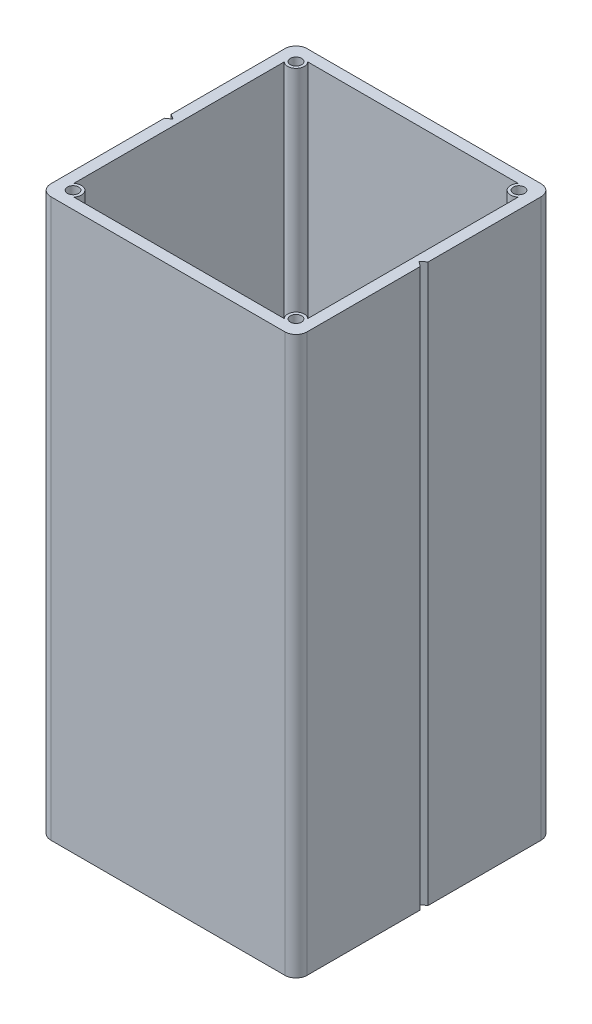
ISO-10303-21;
HEADER;
FILE_DESCRIPTION(('STEP AP214'),'2;1');
FILE_NAME('part.step','',(''),(''),'','','');
FILE_SCHEMA(('AUTOMOTIVE_DESIGN { 1 0 10303 214 1 1 1 1 }'));
ENDSEC;
DATA;
#1=APPLICATION_CONTEXT('core data for automotive mechanical design processes');
#2=APPLICATION_PROTOCOL_DEFINITION('international standard','automotive_design',2000,#1);
#3=PRODUCT_CONTEXT('',#1,'mechanical');
#4=PRODUCT('Part','Part','',(#3));
#5=PRODUCT_RELATED_PRODUCT_CATEGORY('part','',(#4));
#6=PRODUCT_DEFINITION_FORMATION('','',#4);
#7=PRODUCT_DEFINITION_CONTEXT('part definition',#1,'design');
#8=PRODUCT_DEFINITION('design','',#6,#7);
#9=PRODUCT_DEFINITION_SHAPE('','',#8);
#10=(LENGTH_UNIT() NAMED_UNIT(*) SI_UNIT(.MILLI.,.METRE.));
#11=(NAMED_UNIT(*) PLANE_ANGLE_UNIT() SI_UNIT($,.RADIAN.));
#12=(NAMED_UNIT(*) SI_UNIT($,.STERADIAN.) SOLID_ANGLE_UNIT());
#13=UNCERTAINTY_MEASURE_WITH_UNIT(LENGTH_MEASURE(1.E-05),#10,'distance_accuracy_value','');
#14=(GEOMETRIC_REPRESENTATION_CONTEXT(3) GLOBAL_UNCERTAINTY_ASSIGNED_CONTEXT((#13)) GLOBAL_UNIT_ASSIGNED_CONTEXT((#10,
#11,#12)) REPRESENTATION_CONTEXT('',''));
#15=CARTESIAN_POINT('',(0.,0.,0.));
#16=DIRECTION('',(0.,0.,1.));
#17=DIRECTION('',(1.,0.,0.));
#18=AXIS2_PLACEMENT_3D('',#15,#16,#17);
#19=CARTESIAN_POINT('',(0.,100.,0.));
#20=DIRECTION('',(0.,1.,0.));
#21=DIRECTION('',(0.,0.,1.));
#22=AXIS2_PLACEMENT_3D('',#19,#20,#21);
#23=PLANE('',#22);
#24=CARTESIAN_POINT('',(20.,100.,20.));
#25=DIRECTION('',(0.,1.,0.));
#26=DIRECTION('',(0.,0.,1.));
#27=AXIS2_PLACEMENT_3D('',#24,#25,#26);
#28=CIRCLE('',#27,1.);
#29=CARTESIAN_POINT('',(20.,100.,21.));
#30=VERTEX_POINT('',#29);
#31=EDGE_CURVE('E721',#30,#30,#28,.T.);
#32=ORIENTED_EDGE('',*,*,#31,.F.);
#33=EDGE_LOOP('',(#32));
#34=FACE_BOUND('',#33,.T.);
#35=CARTESIAN_POINT('',(-20.,100.,-20.));
#36=DIRECTION('',(0.,1.,0.));
#37=DIRECTION('',(0.,0.,1.));
#38=AXIS2_PLACEMENT_3D('',#35,#36,#37);
#39=CIRCLE('',#38,1.);
#40=CARTESIAN_POINT('',(-20.,100.,-19.));
#41=VERTEX_POINT('',#40);
#42=EDGE_CURVE('E229',#41,#41,#39,.T.);
#43=ORIENTED_EDGE('',*,*,#42,.F.);
#44=EDGE_LOOP('',(#43));
#45=FACE_BOUND('',#44,.T.);
#46=DIRECTION('',(0.,0.,1.));
#47=VECTOR('',#46,1.);
#48=CARTESIAN_POINT('',(-23.,100.,0.601609353344728));
#49=LINE('',#48,#47);
#50=CARTESIAN_POINT('',(-23.,100.,0.601609353344728));
#51=VERTEX_POINT('',#50);
#52=CARTESIAN_POINT('',(-23.,100.,21.));
#53=VERTEX_POINT('',#52);
#54=EDGE_CURVE('E279',#51,#53,#49,.T.);
#55=ORIENTED_EDGE('',*,*,#54,.T.);
#56=CARTESIAN_POINT('',(-21.,100.,21.));
#57=DIRECTION('',(0.,1.,0.));
#58=DIRECTION('',(0.,0.,1.));
#59=AXIS2_PLACEMENT_3D('',#56,#57,#58);
#60=CIRCLE('',#59,2.);
#61=CARTESIAN_POINT('',(-21.,100.,23.));
#62=VERTEX_POINT('',#61);
#63=EDGE_CURVE('E42',#53,#62,#60,.T.);
#64=ORIENTED_EDGE('',*,*,#63,.T.);
#65=DIRECTION('',(1.,0.,0.));
#66=VECTOR('',#65,1.);
#67=CARTESIAN_POINT('',(-23.,100.,23.));
#68=LINE('',#67,#66);
#69=CARTESIAN_POINT('',(21.,100.,23.));
#70=VERTEX_POINT('',#69);
#71=EDGE_CURVE('E281',#62,#70,#68,.T.);
#72=ORIENTED_EDGE('',*,*,#71,.T.);
#73=CARTESIAN_POINT('',(21.,100.,21.));
#74=DIRECTION('',(0.,1.,0.));
#75=DIRECTION('',(0.,0.,1.));
#76=AXIS2_PLACEMENT_3D('',#73,#74,#75);
#77=CIRCLE('',#76,2.);
#78=CARTESIAN_POINT('',(23.,100.,21.));
#79=VERTEX_POINT('',#78);
#80=EDGE_CURVE('E49',#70,#79,#77,.T.);
#81=ORIENTED_EDGE('',*,*,#80,.T.);
#82=DIRECTION('',(0.,0.,-1.));
#83=VECTOR('',#82,1.);
#84=CARTESIAN_POINT('',(23.,100.,0.712327004868129));
#85=LINE('',#84,#83);
#86=CARTESIAN_POINT('',(23.,100.,0.712327004868129));
#87=VERTEX_POINT('',#86);
#88=EDGE_CURVE('E260',#79,#87,#85,.T.);
#89=ORIENTED_EDGE('',*,*,#88,.T.);
#90=DIRECTION('',(-0.793303405409928,0.,-0.608826499887292));
#91=VECTOR('',#90,1.);
#92=CARTESIAN_POINT('',(22.0718350156704,100.,0.));
#93=LINE('',#92,#91);
#94=CARTESIAN_POINT('',(22.0718350156704,100.,0.));
#95=VERTEX_POINT('',#94);
#96=EDGE_CURVE('E262',#87,#95,#93,.T.);
#97=ORIENTED_EDGE('',*,*,#96,.T.);
#98=DIRECTION('',(0.79330340540993,0.,-0.60882649988729));
#99=VECTOR('',#98,1.);
#100=CARTESIAN_POINT('',(23.,100.,-0.71232700486813));
#101=LINE('',#100,#99);
#102=CARTESIAN_POINT('',(23.,100.,-0.71232700486813));
#103=VERTEX_POINT('',#102);
#104=EDGE_CURVE('E265',#95,#103,#101,.T.);
#105=ORIENTED_EDGE('',*,*,#104,.T.);
#106=DIRECTION('',(0.,0.,-1.));
#107=VECTOR('',#106,1.);
#108=CARTESIAN_POINT('',(23.,100.,-23.));
#109=LINE('',#108,#107);
#110=CARTESIAN_POINT('',(23.,100.,-21.));
#111=VERTEX_POINT('',#110);
#112=EDGE_CURVE('E267',#103,#111,#109,.T.);
#113=ORIENTED_EDGE('',*,*,#112,.T.);
#114=CARTESIAN_POINT('',(21.,100.,-21.));
#115=DIRECTION('',(0.,1.,0.));
#116=DIRECTION('',(0.,0.,1.));
#117=AXIS2_PLACEMENT_3D('',#114,#115,#116);
#118=CIRCLE('',#117,2.);
#119=CARTESIAN_POINT('',(21.,100.,-23.));
#120=VERTEX_POINT('',#119);
#121=EDGE_CURVE('E335',#111,#120,#118,.T.);
#122=ORIENTED_EDGE('',*,*,#121,.T.);
#123=DIRECTION('',(-1.,0.,0.));
#124=VECTOR('',#123,1.);
#125=CARTESIAN_POINT('',(-23.,100.,-23.));
#126=LINE('',#125,#124);
#127=CARTESIAN_POINT('',(-21.,100.,-23.));
#128=VERTEX_POINT('',#127);
#129=EDGE_CURVE('E270',#120,#128,#126,.T.);
#130=ORIENTED_EDGE('',*,*,#129,.T.);
#131=CARTESIAN_POINT('',(-21.,100.,-21.));
#132=DIRECTION('',(0.,1.,0.));
#133=DIRECTION('',(0.,0.,1.));
#134=AXIS2_PLACEMENT_3D('',#131,#132,#133);
#135=CIRCLE('',#134,2.);
#136=CARTESIAN_POINT('',(-23.,100.,-21.));
#137=VERTEX_POINT('',#136);
#138=EDGE_CURVE('E333',#128,#137,#135,.T.);
#139=ORIENTED_EDGE('',*,*,#138,.T.);
#140=DIRECTION('',(0.,0.,1.));
#141=VECTOR('',#140,1.);
#142=CARTESIAN_POINT('',(-23.,100.,-23.));
#143=LINE('',#142,#141);
#144=CARTESIAN_POINT('',(-23.,100.,-0.601609353344729));
#145=VERTEX_POINT('',#144);
#146=EDGE_CURVE('E273',#137,#145,#143,.T.);
#147=ORIENTED_EDGE('',*,*,#146,.T.);
#148=DIRECTION('',(0.838431545709669,0.,0.545006920285326));
#149=VECTOR('',#148,1.);
#150=CARTESIAN_POINT('',(-23.,100.,-0.601609353344729));
#151=LINE('',#150,#149);
#152=CARTESIAN_POINT('',(-22.0744920086994,100.,0.));
#153=VERTEX_POINT('',#152);
#154=EDGE_CURVE('E275',#145,#153,#151,.T.);
#155=ORIENTED_EDGE('',*,*,#154,.T.);
#156=DIRECTION('',(-0.838431545709669,0.,0.545006920285325));
#157=VECTOR('',#156,1.);
#158=CARTESIAN_POINT('',(-22.0744920086994,100.,0.));
#159=LINE('',#158,#157);
#160=EDGE_CURVE('E277',#153,#51,#159,.T.);
#161=ORIENTED_EDGE('',*,*,#160,.T.);
#162=EDGE_LOOP('',(#55,#64,#72,#81,#89,#97,#105,#113,#122,#130,#139,#147,#155,#161));
#163=FACE_BOUND('',#162,.T.);
#164=DIRECTION('',(0.,0.,-1.));
#165=VECTOR('',#164,1.);
#166=CARTESIAN_POINT('',(21.,100.,-18.8819660112501));
#167=LINE('',#166,#165);
#168=CARTESIAN_POINT('',(21.,100.,18.8819660112501));
#169=VERTEX_POINT('',#168);
#170=CARTESIAN_POINT('',(21.,100.,-18.8819660112501));
#171=VERTEX_POINT('',#170);
#172=EDGE_CURVE('E197',#169,#171,#167,.T.);
#173=ORIENTED_EDGE('',*,*,#172,.F.);
#174=CARTESIAN_POINT('',(20.,100.,20.));
#175=DIRECTION('',(0.,-1.,0.));
#176=DIRECTION('',(0.,0.,1.));
#177=AXIS2_PLACEMENT_3D('',#174,#175,#176);
#178=CIRCLE('',#177,1.5);
#179=CARTESIAN_POINT('',(18.8819660112501,100.,21.));
#180=VERTEX_POINT('',#179);
#181=EDGE_CURVE('E187',#180,#169,#178,.T.);
#182=ORIENTED_EDGE('',*,*,#181,.F.);
#183=DIRECTION('',(1.,0.,0.));
#184=VECTOR('',#183,1.);
#185=CARTESIAN_POINT('',(-18.8819660112501,100.,21.));
#186=LINE('',#185,#184);
#187=CARTESIAN_POINT('',(-18.8819660112501,100.,21.));
#188=VERTEX_POINT('',#187);
#189=EDGE_CURVE('E225',#188,#180,#186,.T.);
#190=ORIENTED_EDGE('',*,*,#189,.F.);
#191=CARTESIAN_POINT('',(-20.,100.,20.));
#192=DIRECTION('',(0.,-1.,0.));
#193=DIRECTION('',(0.,0.,1.));
#194=AXIS2_PLACEMENT_3D('',#191,#192,#193);
#195=CIRCLE('',#194,1.5);
#196=CARTESIAN_POINT('',(-21.,100.,18.8819660112501));
#197=VERTEX_POINT('',#196);
#198=EDGE_CURVE('E222',#197,#188,#195,.T.);
#199=ORIENTED_EDGE('',*,*,#198,.F.);
#200=DIRECTION('',(0.,0.,1.));
#201=VECTOR('',#200,1.);
#202=CARTESIAN_POINT('',(-21.,100.,-18.8819660112501));
#203=LINE('',#202,#201);
#204=CARTESIAN_POINT('',(-21.,100.,-18.8819660112501));
#205=VERTEX_POINT('',#204);
#206=EDGE_CURVE('E220',#205,#197,#203,.T.);
#207=ORIENTED_EDGE('',*,*,#206,.F.);
#208=CARTESIAN_POINT('',(-20.,100.,-20.));
#209=DIRECTION('',(0.,-1.,0.));
#210=DIRECTION('',(0.,0.,1.));
#211=AXIS2_PLACEMENT_3D('',#208,#209,#210);
#212=CIRCLE('',#211,1.5);
#213=CARTESIAN_POINT('',(-18.8819660112501,100.,-21.));
#214=VERTEX_POINT('',#213);
#215=EDGE_CURVE('E218',#214,#205,#212,.T.);
#216=ORIENTED_EDGE('',*,*,#215,.F.);
#217=DIRECTION('',(-1.,0.,0.));
#218=VECTOR('',#217,1.);
#219=CARTESIAN_POINT('',(-18.8819660112501,100.,-21.));
#220=LINE('',#219,#218);
#221=CARTESIAN_POINT('',(18.8819660112501,100.,-21.));
#222=VERTEX_POINT('',#221);
#223=EDGE_CURVE('E213',#222,#214,#220,.T.);
#224=ORIENTED_EDGE('',*,*,#223,.F.);
#225=CARTESIAN_POINT('',(20.,100.,-20.));
#226=DIRECTION('',(0.,-1.,0.));
#227=DIRECTION('',(0.,0.,1.));
#228=AXIS2_PLACEMENT_3D('',#225,#226,#227);
#229=CIRCLE('',#228,1.5);
#230=EDGE_CURVE('E211',#171,#222,#229,.T.);
#231=ORIENTED_EDGE('',*,*,#230,.F.);
#232=EDGE_LOOP('',(#173,#182,#190,#199,#207,#216,#224,#231));
#233=FACE_BOUND('',#232,.T.);
#234=CARTESIAN_POINT('',(20.,100.,-20.));
#235=DIRECTION('',(0.,1.,0.));
#236=DIRECTION('',(0.,0.,1.));
#237=AXIS2_PLACEMENT_3D('',#234,#235,#236);
#238=CIRCLE('',#237,1.);
#239=CARTESIAN_POINT('',(20.,100.,-19.));
#240=VERTEX_POINT('',#239);
#241=EDGE_CURVE('E725',#240,#240,#238,.T.);
#242=ORIENTED_EDGE('',*,*,#241,.F.);
#243=EDGE_LOOP('',(#242));
#244=FACE_BOUND('',#243,.T.);
#245=CARTESIAN_POINT('',(-20.,100.,20.));
#246=DIRECTION('',(0.,1.,0.));
#247=DIRECTION('',(0.,0.,1.));
#248=AXIS2_PLACEMENT_3D('',#245,#246,#247);
#249=CIRCLE('',#248,1.);
#250=CARTESIAN_POINT('',(-20.,100.,21.));
#251=VERTEX_POINT('',#250);
#252=EDGE_CURVE('E712',#251,#251,#249,.T.);
#253=ORIENTED_EDGE('',*,*,#252,.F.);
#254=EDGE_LOOP('',(#253));
#255=FACE_BOUND('',#254,.T.);
#256=ADVANCED_FACE('F34',(#34,#45,#163,#233,#244,#255),#23,.T.);
#257=CARTESIAN_POINT('',(0.,0.,0.));
#258=DIRECTION('',(0.,1.,0.));
#259=DIRECTION('',(0.,0.,1.));
#260=AXIS2_PLACEMENT_3D('',#257,#258,#259);
#261=PLANE('',#260);
#262=DIRECTION('',(1.,0.,0.));
#263=VECTOR('',#262,1.);
#264=CARTESIAN_POINT('',(-23.,0.,23.));
#265=LINE('',#264,#263);
#266=CARTESIAN_POINT('',(-21.,0.,23.));
#267=VERTEX_POINT('',#266);
#268=CARTESIAN_POINT('',(21.,0.,23.));
#269=VERTEX_POINT('',#268);
#270=EDGE_CURVE('E263',#267,#269,#265,.T.);
#271=ORIENTED_EDGE('',*,*,#270,.F.);
#272=CARTESIAN_POINT('',(-21.,0.,21.));
#273=DIRECTION('',(0.,1.,0.));
#274=DIRECTION('',(0.,0.,1.));
#275=AXIS2_PLACEMENT_3D('',#272,#273,#274);
#276=CIRCLE('',#275,2.);
#277=CARTESIAN_POINT('',(-23.,0.,21.));
#278=VERTEX_POINT('',#277);
#279=EDGE_CURVE('E347',#267,#278,#276,.F.);
#280=ORIENTED_EDGE('',*,*,#279,.T.);
#281=DIRECTION('',(0.,0.,1.));
#282=VECTOR('',#281,1.);
#283=CARTESIAN_POINT('',(-23.,0.,0.601609353344728));
#284=LINE('',#283,#282);
#285=CARTESIAN_POINT('',(-23.,0.,0.601609353344728));
#286=VERTEX_POINT('',#285);
#287=EDGE_CURVE('E301',#286,#278,#284,.T.);
#288=ORIENTED_EDGE('',*,*,#287,.F.);
#289=DIRECTION('',(-0.838431545709669,0.,0.545006920285325));
#290=VECTOR('',#289,1.);
#291=CARTESIAN_POINT('',(-22.0744920086994,0.,0.));
#292=LINE('',#291,#290);
#293=CARTESIAN_POINT('',(-22.0744920086994,0.,0.));
#294=VERTEX_POINT('',#293);
#295=EDGE_CURVE('E299',#294,#286,#292,.T.);
#296=ORIENTED_EDGE('',*,*,#295,.F.);
#297=DIRECTION('',(0.838431545709669,0.,0.545006920285326));
#298=VECTOR('',#297,1.);
#299=CARTESIAN_POINT('',(-23.,0.,-0.601609353344729));
#300=LINE('',#299,#298);
#301=CARTESIAN_POINT('',(-23.,0.,-0.601609353344729));
#302=VERTEX_POINT('',#301);
#303=EDGE_CURVE('E297',#302,#294,#300,.T.);
#304=ORIENTED_EDGE('',*,*,#303,.F.);
#305=DIRECTION('',(0.,0.,1.));
#306=VECTOR('',#305,1.);
#307=CARTESIAN_POINT('',(-23.,0.,-23.));
#308=LINE('',#307,#306);
#309=CARTESIAN_POINT('',(-23.,0.,-21.));
#310=VERTEX_POINT('',#309);
#311=EDGE_CURVE('E295',#310,#302,#308,.T.);
#312=ORIENTED_EDGE('',*,*,#311,.F.);
#313=CARTESIAN_POINT('',(-21.,0.,-21.));
#314=DIRECTION('',(0.,1.,0.));
#315=DIRECTION('',(0.,0.,1.));
#316=AXIS2_PLACEMENT_3D('',#313,#314,#315);
#317=CIRCLE('',#316,2.);
#318=CARTESIAN_POINT('',(-21.,0.,-23.));
#319=VERTEX_POINT('',#318);
#320=EDGE_CURVE('E327',#310,#319,#317,.F.);
#321=ORIENTED_EDGE('',*,*,#320,.T.);
#322=DIRECTION('',(-1.,0.,0.));
#323=VECTOR('',#322,1.);
#324=CARTESIAN_POINT('',(-23.,0.,-23.));
#325=LINE('',#324,#323);
#326=CARTESIAN_POINT('',(21.,0.,-23.));
#327=VERTEX_POINT('',#326);
#328=EDGE_CURVE('E292',#327,#319,#325,.T.);
#329=ORIENTED_EDGE('',*,*,#328,.F.);
#330=CARTESIAN_POINT('',(21.,0.,-21.));
#331=DIRECTION('',(0.,1.,0.));
#332=DIRECTION('',(0.,0.,1.));
#333=AXIS2_PLACEMENT_3D('',#330,#331,#332);
#334=CIRCLE('',#333,2.);
#335=CARTESIAN_POINT('',(23.,0.,-21.));
#336=VERTEX_POINT('',#335);
#337=EDGE_CURVE('E329',#327,#336,#334,.F.);
#338=ORIENTED_EDGE('',*,*,#337,.T.);
#339=DIRECTION('',(0.,0.,-1.));
#340=VECTOR('',#339,1.);
#341=CARTESIAN_POINT('',(23.,0.,-23.));
#342=LINE('',#341,#340);
#343=CARTESIAN_POINT('',(23.,0.,-0.71232700486813));
#344=VERTEX_POINT('',#343);
#345=EDGE_CURVE('E289',#344,#336,#342,.T.);
#346=ORIENTED_EDGE('',*,*,#345,.F.);
#347=DIRECTION('',(0.79330340540993,0.,-0.60882649988729));
#348=VECTOR('',#347,1.);
#349=CARTESIAN_POINT('',(23.,0.,-0.71232700486813));
#350=LINE('',#349,#348);
#351=CARTESIAN_POINT('',(22.0718350156704,0.,0.));
#352=VERTEX_POINT('',#351);
#353=EDGE_CURVE('E287',#352,#344,#350,.T.);
#354=ORIENTED_EDGE('',*,*,#353,.F.);
#355=DIRECTION('',(-0.793303405409928,0.,-0.608826499887292));
#356=VECTOR('',#355,1.);
#357=CARTESIAN_POINT('',(22.0718350156704,0.,0.));
#358=LINE('',#357,#356);
#359=CARTESIAN_POINT('',(23.,0.,0.712327004868129));
#360=VERTEX_POINT('',#359);
#361=EDGE_CURVE('E285',#360,#352,#358,.T.);
#362=ORIENTED_EDGE('',*,*,#361,.F.);
#363=DIRECTION('',(0.,0.,-1.));
#364=VECTOR('',#363,1.);
#365=CARTESIAN_POINT('',(23.,0.,0.712327004868129));
#366=LINE('',#365,#364);
#367=CARTESIAN_POINT('',(23.,0.,21.));
#368=VERTEX_POINT('',#367);
#369=EDGE_CURVE('E205',#368,#360,#366,.T.);
#370=ORIENTED_EDGE('',*,*,#369,.F.);
#371=CARTESIAN_POINT('',(21.,0.,21.));
#372=DIRECTION('',(0.,1.,0.));
#373=DIRECTION('',(0.,0.,1.));
#374=AXIS2_PLACEMENT_3D('',#371,#372,#373);
#375=CIRCLE('',#374,2.);
#376=EDGE_CURVE('E345',#368,#269,#375,.F.);
#377=ORIENTED_EDGE('',*,*,#376,.T.);
#378=EDGE_LOOP('',(#271,#280,#288,#296,#304,#312,#321,#329,#338,#346,#354,#362,#370,#377));
#379=FACE_BOUND('',#378,.T.);
#380=CARTESIAN_POINT('',(20.,0.,20.));
#381=DIRECTION('',(0.,-1.,0.));
#382=DIRECTION('',(0.,0.,1.));
#383=AXIS2_PLACEMENT_3D('',#380,#381,#382);
#384=CIRCLE('',#383,1.5);
#385=CARTESIAN_POINT('',(18.8819660112501,0.,21.));
#386=VERTEX_POINT('',#385);
#387=CARTESIAN_POINT('',(21.,0.,18.8819660112501));
#388=VERTEX_POINT('',#387);
#389=EDGE_CURVE('E227',#386,#388,#384,.T.);
#390=ORIENTED_EDGE('',*,*,#389,.T.);
#391=DIRECTION('',(0.,0.,-1.));
#392=VECTOR('',#391,1.);
#393=CARTESIAN_POINT('',(21.,0.,-18.8819660112501));
#394=LINE('',#393,#392);
#395=CARTESIAN_POINT('',(21.,0.,-18.8819660112501));
#396=VERTEX_POINT('',#395);
#397=EDGE_CURVE('E204',#388,#396,#394,.T.);
#398=ORIENTED_EDGE('',*,*,#397,.T.);
#399=CARTESIAN_POINT('',(20.,0.,-20.));
#400=DIRECTION('',(0.,-1.,0.));
#401=DIRECTION('',(0.,0.,1.));
#402=AXIS2_PLACEMENT_3D('',#399,#400,#401);
#403=CIRCLE('',#402,1.5);
#404=CARTESIAN_POINT('',(18.8819660112501,0.,-21.));
#405=VERTEX_POINT('',#404);
#406=EDGE_CURVE('E231',#396,#405,#403,.T.);
#407=ORIENTED_EDGE('',*,*,#406,.T.);
#408=DIRECTION('',(-1.,0.,0.));
#409=VECTOR('',#408,1.);
#410=CARTESIAN_POINT('',(-18.8819660112501,0.,-21.));
#411=LINE('',#410,#409);
#412=CARTESIAN_POINT('',(-18.8819660112501,0.,-21.));
#413=VERTEX_POINT('',#412);
#414=EDGE_CURVE('E234',#405,#413,#411,.T.);
#415=ORIENTED_EDGE('',*,*,#414,.T.);
#416=CARTESIAN_POINT('',(-20.,0.,-20.));
#417=DIRECTION('',(0.,-1.,0.));
#418=DIRECTION('',(0.,0.,1.));
#419=AXIS2_PLACEMENT_3D('',#416,#417,#418);
#420=CIRCLE('',#419,1.5);
#421=CARTESIAN_POINT('',(-21.,0.,-18.8819660112501));
#422=VERTEX_POINT('',#421);
#423=EDGE_CURVE('E237',#413,#422,#420,.T.);
#424=ORIENTED_EDGE('',*,*,#423,.T.);
#425=DIRECTION('',(0.,0.,1.));
#426=VECTOR('',#425,1.);
#427=CARTESIAN_POINT('',(-21.,0.,-18.8819660112501));
#428=LINE('',#427,#426);
#429=CARTESIAN_POINT('',(-21.,0.,18.8819660112501));
#430=VERTEX_POINT('',#429);
#431=EDGE_CURVE('E240',#422,#430,#428,.T.);
#432=ORIENTED_EDGE('',*,*,#431,.T.);
#433=CARTESIAN_POINT('',(-20.,0.,20.));
#434=DIRECTION('',(0.,-1.,0.));
#435=DIRECTION('',(0.,0.,1.));
#436=AXIS2_PLACEMENT_3D('',#433,#434,#435);
#437=CIRCLE('',#436,1.5);
#438=CARTESIAN_POINT('',(-18.8819660112501,0.,21.));
#439=VERTEX_POINT('',#438);
#440=EDGE_CURVE('E243',#430,#439,#437,.T.);
#441=ORIENTED_EDGE('',*,*,#440,.T.);
#442=DIRECTION('',(1.,0.,0.));
#443=VECTOR('',#442,1.);
#444=CARTESIAN_POINT('',(-18.8819660112501,0.,21.));
#445=LINE('',#444,#443);
#446=EDGE_CURVE('E198',#439,#386,#445,.T.);
#447=ORIENTED_EDGE('',*,*,#446,.T.);
#448=EDGE_LOOP('',(#390,#398,#407,#415,#424,#432,#441,#447));
#449=FACE_BOUND('',#448,.T.);
#450=CARTESIAN_POINT('',(-20.,0.,-20.));
#451=DIRECTION('',(0.,1.,0.));
#452=DIRECTION('',(0.,0.,1.));
#453=AXIS2_PLACEMENT_3D('',#450,#451,#452);
#454=CIRCLE('',#453,1.);
#455=CARTESIAN_POINT('',(-20.,0.,-19.));
#456=VERTEX_POINT('',#455);
#457=EDGE_CURVE('E699',#456,#456,#454,.T.);
#458=ORIENTED_EDGE('',*,*,#457,.T.);
#459=EDGE_LOOP('',(#458));
#460=FACE_BOUND('',#459,.T.);
#461=CARTESIAN_POINT('',(20.,0.,-20.));
#462=DIRECTION('',(0.,1.,0.));
#463=DIRECTION('',(0.,0.,1.));
#464=AXIS2_PLACEMENT_3D('',#461,#462,#463);
#465=CIRCLE('',#464,1.);
#466=CARTESIAN_POINT('',(20.,0.,-19.));
#467=VERTEX_POINT('',#466);
#468=EDGE_CURVE('E703',#467,#467,#465,.T.);
#469=ORIENTED_EDGE('',*,*,#468,.T.);
#470=EDGE_LOOP('',(#469));
#471=FACE_BOUND('',#470,.T.);
#472=CARTESIAN_POINT('',(20.,0.,20.));
#473=DIRECTION('',(0.,1.,0.));
#474=DIRECTION('',(0.,0.,1.));
#475=AXIS2_PLACEMENT_3D('',#472,#473,#474);
#476=CIRCLE('',#475,1.);
#477=CARTESIAN_POINT('',(20.,0.,21.));
#478=VERTEX_POINT('',#477);
#479=EDGE_CURVE('E707',#478,#478,#476,.T.);
#480=ORIENTED_EDGE('',*,*,#479,.T.);
#481=EDGE_LOOP('',(#480));
#482=FACE_BOUND('',#481,.T.);
#483=CARTESIAN_POINT('',(-20.,0.,20.));
#484=DIRECTION('',(0.,1.,0.));
#485=DIRECTION('',(0.,0.,1.));
#486=AXIS2_PLACEMENT_3D('',#483,#484,#485);
#487=CIRCLE('',#486,1.);
#488=CARTESIAN_POINT('',(-20.,0.,21.));
#489=VERTEX_POINT('',#488);
#490=EDGE_CURVE('E710',#489,#489,#487,.T.);
#491=ORIENTED_EDGE('',*,*,#490,.T.);
#492=EDGE_LOOP('',(#491));
#493=FACE_BOUND('',#492,.T.);
#494=ADVANCED_FACE('F361',(#379,#449,#460,#471,#482,#493),#261,.F.);
#495=CARTESIAN_POINT('',(23.,100.,0.712327004868129));
#496=DIRECTION('',(-1.,0.,0.));
#497=DIRECTION('',(0.,0.,1.));
#498=AXIS2_PLACEMENT_3D('',#495,#496,#497);
#499=PLANE('',#498);
#500=ORIENTED_EDGE('',*,*,#88,.F.);
#501=DIRECTION('',(0.,-1.,0.));
#502=VECTOR('',#501,1.);
#503=CARTESIAN_POINT('',(23.,100.,21.));
#504=LINE('',#503,#502);
#505=EDGE_CURVE('E11',#79,#368,#504,.T.);
#506=ORIENTED_EDGE('',*,*,#505,.T.);
#507=ORIENTED_EDGE('',*,*,#369,.T.);
#508=DIRECTION('',(0.,-1.,0.));
#509=VECTOR('',#508,1.);
#510=CARTESIAN_POINT('',(23.,100.,0.712327004868129));
#511=LINE('',#510,#509);
#512=EDGE_CURVE('E319',#87,#360,#511,.T.);
#513=ORIENTED_EDGE('',*,*,#512,.F.);
#514=EDGE_LOOP('',(#500,#506,#507,#513));
#515=FACE_BOUND('',#514,.T.);
#516=ADVANCED_FACE('F410',(#515),#499,.F.);
#517=CARTESIAN_POINT('',(22.0718350156704,100.,0.));
#518=DIRECTION('',(-0.608826499887292,0.,0.793303405409928));
#519=DIRECTION('',(0.793303405409929,0.,0.608826499887292));
#520=AXIS2_PLACEMENT_3D('',#517,#518,#519);
#521=PLANE('',#520);
#522=ORIENTED_EDGE('',*,*,#361,.T.);
#523=DIRECTION('',(0.,-1.,0.));
#524=VECTOR('',#523,1.);
#525=CARTESIAN_POINT('',(22.0718350156704,100.,0.));
#526=LINE('',#525,#524);
#527=EDGE_CURVE('E316',#95,#352,#526,.T.);
#528=ORIENTED_EDGE('',*,*,#527,.F.);
#529=ORIENTED_EDGE('',*,*,#96,.F.);
#530=ORIENTED_EDGE('',*,*,#512,.T.);
#531=EDGE_LOOP('',(#522,#528,#529,#530));
#532=FACE_BOUND('',#531,.T.);
#533=ADVANCED_FACE('F408',(#532),#521,.F.);
#534=CARTESIAN_POINT('',(23.,100.,-0.71232700486813));
#535=DIRECTION('',(-0.60882649988729,0.,-0.79330340540993));
#536=DIRECTION('',(-0.79330340540993,0.,0.60882649988729));
#537=AXIS2_PLACEMENT_3D('',#534,#535,#536);
#538=PLANE('',#537);
#539=ORIENTED_EDGE('',*,*,#353,.T.);
#540=DIRECTION('',(0.,-1.,0.));
#541=VECTOR('',#540,1.);
#542=CARTESIAN_POINT('',(23.,100.,-0.71232700486813));
#543=LINE('',#542,#541);
#544=EDGE_CURVE('E313',#103,#344,#543,.T.);
#545=ORIENTED_EDGE('',*,*,#544,.F.);
#546=ORIENTED_EDGE('',*,*,#104,.F.);
#547=ORIENTED_EDGE('',*,*,#527,.T.);
#548=EDGE_LOOP('',(#539,#545,#546,#547));
#549=FACE_BOUND('',#548,.T.);
#550=ADVANCED_FACE('F401',(#549),#538,.F.);
#551=CARTESIAN_POINT('',(23.,100.,-23.));
#552=DIRECTION('',(-1.,0.,0.));
#553=DIRECTION('',(0.,0.,1.));
#554=AXIS2_PLACEMENT_3D('',#551,#552,#553);
#555=PLANE('',#554);
#556=ORIENTED_EDGE('',*,*,#345,.T.);
#557=DIRECTION('',(0.,-1.,0.));
#558=VECTOR('',#557,1.);
#559=CARTESIAN_POINT('',(23.,100.,-21.));
#560=LINE('',#559,#558);
#561=EDGE_CURVE('E331',#336,#111,#560,.F.);
#562=ORIENTED_EDGE('',*,*,#561,.T.);
#563=ORIENTED_EDGE('',*,*,#112,.F.);
#564=ORIENTED_EDGE('',*,*,#544,.T.);
#565=EDGE_LOOP('',(#556,#562,#563,#564));
#566=FACE_BOUND('',#565,.T.);
#567=ADVANCED_FACE('F396',(#566),#555,.F.);
#568=CARTESIAN_POINT('',(-23.,100.,-23.));
#569=DIRECTION('',(0.,0.,1.));
#570=DIRECTION('',(1.,0.,0.));
#571=AXIS2_PLACEMENT_3D('',#568,#569,#570);
#572=PLANE('',#571);
#573=CARTESIAN_POINT('',(7.99999999999999,50.,-23.));
#574=DIRECTION('',(0.,0.,-1.));
#575=DIRECTION('',(-1.,0.,0.));
#576=AXIS2_PLACEMENT_3D('',#573,#574,#575);
#577=CIRCLE('',#576,1.5);
#578=CARTESIAN_POINT('',(6.49999999999999,50.,-23.));
#579=VERTEX_POINT('',#578);
#580=EDGE_CURVE('E740',#579,#579,#577,.T.);
#581=ORIENTED_EDGE('',*,*,#580,.F.);
#582=EDGE_LOOP('',(#581));
#583=FACE_BOUND('',#582,.T.);
#584=CARTESIAN_POINT('',(-8.00000000000001,50.,-23.));
#585=DIRECTION('',(0.,0.,-1.));
#586=DIRECTION('',(-1.,0.,0.));
#587=AXIS2_PLACEMENT_3D('',#584,#585,#586);
#588=CIRCLE('',#587,1.5);
#589=CARTESIAN_POINT('',(-9.50000000000001,50.,-23.));
#590=VERTEX_POINT('',#589);
#591=EDGE_CURVE('E713',#590,#590,#588,.T.);
#592=ORIENTED_EDGE('',*,*,#591,.F.);
#593=EDGE_LOOP('',(#592));
#594=FACE_BOUND('',#593,.T.);
#595=ORIENTED_EDGE('',*,*,#129,.F.);
#596=DIRECTION('',(0.,-1.,0.));
#597=VECTOR('',#596,1.);
#598=CARTESIAN_POINT('',(21.,100.,-23.));
#599=LINE('',#598,#597);
#600=EDGE_CURVE('E324',#120,#327,#599,.T.);
#601=ORIENTED_EDGE('',*,*,#600,.T.);
#602=ORIENTED_EDGE('',*,*,#328,.T.);
#603=DIRECTION('',(0.,-1.,0.));
#604=VECTOR('',#603,1.);
#605=CARTESIAN_POINT('',(-21.,100.,-23.));
#606=LINE('',#605,#604);
#607=EDGE_CURVE('E322',#319,#128,#606,.F.);
#608=ORIENTED_EDGE('',*,*,#607,.T.);
#609=EDGE_LOOP('',(#595,#601,#602,#608));
#610=FACE_BOUND('',#609,.T.);
#611=ADVANCED_FACE('F387',(#583,#594,#610),#572,.F.);
#612=CARTESIAN_POINT('',(-23.,100.,-23.));
#613=DIRECTION('',(1.,0.,0.));
#614=DIRECTION('',(0.,0.,-1.));
#615=AXIS2_PLACEMENT_3D('',#612,#613,#614);
#616=PLANE('',#615);
#617=ORIENTED_EDGE('',*,*,#146,.F.);
#618=DIRECTION('',(0.,-1.,0.));
#619=VECTOR('',#618,1.);
#620=CARTESIAN_POINT('',(-23.,100.,-21.));
#621=LINE('',#620,#619);
#622=EDGE_CURVE('E337',#137,#310,#621,.T.);
#623=ORIENTED_EDGE('',*,*,#622,.T.);
#624=ORIENTED_EDGE('',*,*,#311,.T.);
#625=DIRECTION('',(0.,-1.,0.));
#626=VECTOR('',#625,1.);
#627=CARTESIAN_POINT('',(-23.,100.,-0.601609353344729));
#628=LINE('',#627,#626);
#629=EDGE_CURVE('E310',#145,#302,#628,.T.);
#630=ORIENTED_EDGE('',*,*,#629,.F.);
#631=EDGE_LOOP('',(#617,#623,#624,#630));
#632=FACE_BOUND('',#631,.T.);
#633=ADVANCED_FACE('F378',(#632),#616,.F.);
#634=CARTESIAN_POINT('',(-23.,100.,-0.601609353344729));
#635=DIRECTION('',(0.545006920285326,0.,-0.838431545709669));
#636=DIRECTION('',(-0.838431545709669,0.,-0.545006920285326));
#637=AXIS2_PLACEMENT_3D('',#634,#635,#636);
#638=PLANE('',#637);
#639=ORIENTED_EDGE('',*,*,#303,.T.);
#640=DIRECTION('',(0.,-1.,0.));
#641=VECTOR('',#640,1.);
#642=CARTESIAN_POINT('',(-22.0744920086994,100.,0.));
#643=LINE('',#642,#641);
#644=EDGE_CURVE('E307',#153,#294,#643,.T.);
#645=ORIENTED_EDGE('',*,*,#644,.F.);
#646=ORIENTED_EDGE('',*,*,#154,.F.);
#647=ORIENTED_EDGE('',*,*,#629,.T.);
#648=EDGE_LOOP('',(#639,#645,#646,#647));
#649=FACE_BOUND('',#648,.T.);
#650=ADVANCED_FACE('F373',(#649),#638,.F.);
#651=CARTESIAN_POINT('',(-22.0744920086994,100.,0.));
#652=DIRECTION('',(0.545006920285325,0.,0.838431545709669));
#653=DIRECTION('',(0.838431545709669,0.,-0.545006920285325));
#654=AXIS2_PLACEMENT_3D('',#651,#652,#653);
#655=PLANE('',#654);
#656=ORIENTED_EDGE('',*,*,#295,.T.);
#657=DIRECTION('',(0.,-1.,0.));
#658=VECTOR('',#657,1.);
#659=CARTESIAN_POINT('',(-23.,100.,0.601609353344728));
#660=LINE('',#659,#658);
#661=EDGE_CURVE('E283',#51,#286,#660,.T.);
#662=ORIENTED_EDGE('',*,*,#661,.F.);
#663=ORIENTED_EDGE('',*,*,#160,.F.);
#664=ORIENTED_EDGE('',*,*,#644,.T.);
#665=EDGE_LOOP('',(#656,#662,#663,#664));
#666=FACE_BOUND('',#665,.T.);
#667=ADVANCED_FACE('F368',(#666),#655,.F.);
#668=CARTESIAN_POINT('',(-23.,100.,0.601609353344728));
#669=DIRECTION('',(1.,0.,0.));
#670=DIRECTION('',(0.,0.,-1.));
#671=AXIS2_PLACEMENT_3D('',#668,#669,#670);
#672=PLANE('',#671);
#673=ORIENTED_EDGE('',*,*,#287,.T.);
#674=DIRECTION('',(0.,-1.,0.));
#675=VECTOR('',#674,1.);
#676=CARTESIAN_POINT('',(-23.,100.,21.));
#677=LINE('',#676,#675);
#678=EDGE_CURVE('E57',#278,#53,#677,.F.);
#679=ORIENTED_EDGE('',*,*,#678,.T.);
#680=ORIENTED_EDGE('',*,*,#54,.F.);
#681=ORIENTED_EDGE('',*,*,#661,.T.);
#682=EDGE_LOOP('',(#673,#679,#680,#681));
#683=FACE_BOUND('',#682,.T.);
#684=ADVANCED_FACE('F364',(#683),#672,.F.);
#685=CARTESIAN_POINT('',(-23.,100.,23.));
#686=DIRECTION('',(0.,0.,-1.));
#687=DIRECTION('',(-1.,0.,0.));
#688=AXIS2_PLACEMENT_3D('',#685,#686,#687);
#689=PLANE('',#688);
#690=ORIENTED_EDGE('',*,*,#71,.F.);
#691=DIRECTION('',(0.,-1.,0.));
#692=VECTOR('',#691,1.);
#693=CARTESIAN_POINT('',(-21.,100.,23.));
#694=LINE('',#693,#692);
#695=EDGE_CURVE('E342',#62,#267,#694,.T.);
#696=ORIENTED_EDGE('',*,*,#695,.T.);
#697=ORIENTED_EDGE('',*,*,#270,.T.);
#698=DIRECTION('',(0.,-1.,0.));
#699=VECTOR('',#698,1.);
#700=CARTESIAN_POINT('',(21.,100.,23.));
#701=LINE('',#700,#699);
#702=EDGE_CURVE('E340',#269,#70,#701,.F.);
#703=ORIENTED_EDGE('',*,*,#702,.T.);
#704=EDGE_LOOP('',(#690,#696,#697,#703));
#705=FACE_BOUND('',#704,.T.);
#706=ADVANCED_FACE('F355',(#705),#689,.F.);
#707=CARTESIAN_POINT('',(20.,100.,20.));
#708=DIRECTION('',(0.,-1.,0.));
#709=DIRECTION('',(0.,0.,-1.));
#710=AXIS2_PLACEMENT_3D('',#707,#708,#709);
#711=CYLINDRICAL_SURFACE('',#710,1.5);
#712=ORIENTED_EDGE('',*,*,#389,.F.);
#713=DIRECTION('',(0.,-1.,0.));
#714=VECTOR('',#713,1.);
#715=CARTESIAN_POINT('',(18.8819660112501,100.,21.));
#716=LINE('',#715,#714);
#717=EDGE_CURVE('E193',#180,#386,#716,.T.);
#718=ORIENTED_EDGE('',*,*,#717,.F.);
#719=ORIENTED_EDGE('',*,*,#181,.T.);
#720=DIRECTION('',(0.,-1.,0.));
#721=VECTOR('',#720,1.);
#722=CARTESIAN_POINT('',(21.,100.,18.8819660112501));
#723=LINE('',#722,#721);
#724=EDGE_CURVE('E190',#169,#388,#723,.T.);
#725=ORIENTED_EDGE('',*,*,#724,.T.);
#726=EDGE_LOOP('',(#712,#718,#719,#725));
#727=FACE_BOUND('',#726,.T.);
#728=ADVANCED_FACE('F189',(#727),#711,.T.);
#729=CARTESIAN_POINT('',(21.,100.,-18.8819660112501));
#730=DIRECTION('',(-1.,0.,0.));
#731=DIRECTION('',(0.,0.,1.));
#732=AXIS2_PLACEMENT_3D('',#729,#730,#731);
#733=PLANE('',#732);
#734=ORIENTED_EDGE('',*,*,#397,.F.);
#735=ORIENTED_EDGE('',*,*,#724,.F.);
#736=ORIENTED_EDGE('',*,*,#172,.T.);
#737=DIRECTION('',(0.,-1.,0.));
#738=VECTOR('',#737,1.);
#739=CARTESIAN_POINT('',(21.,100.,-18.8819660112501));
#740=LINE('',#739,#738);
#741=EDGE_CURVE('E206',#171,#396,#740,.T.);
#742=ORIENTED_EDGE('',*,*,#741,.T.);
#743=EDGE_LOOP('',(#734,#735,#736,#742));
#744=FACE_BOUND('',#743,.T.);
#745=ADVANCED_FACE('F201',(#744),#733,.T.);
#746=CARTESIAN_POINT('',(20.,100.,-20.));
#747=DIRECTION('',(0.,-1.,0.));
#748=DIRECTION('',(0.,0.,-1.));
#749=AXIS2_PLACEMENT_3D('',#746,#747,#748);
#750=CYLINDRICAL_SURFACE('',#749,1.5);
#751=ORIENTED_EDGE('',*,*,#406,.F.);
#752=ORIENTED_EDGE('',*,*,#741,.F.);
#753=ORIENTED_EDGE('',*,*,#230,.T.);
#754=DIRECTION('',(0.,-1.,0.));
#755=VECTOR('',#754,1.);
#756=CARTESIAN_POINT('',(18.8819660112501,100.,-21.));
#757=LINE('',#756,#755);
#758=EDGE_CURVE('E257',#222,#405,#757,.T.);
#759=ORIENTED_EDGE('',*,*,#758,.T.);
#760=EDGE_LOOP('',(#751,#752,#753,#759));
#761=FACE_BOUND('',#760,.T.);
#762=ADVANCED_FACE('F503',(#761),#750,.T.);
#763=CARTESIAN_POINT('',(-18.8819660112501,100.,-21.));
#764=DIRECTION('',(0.,0.,1.));
#765=DIRECTION('',(1.,0.,0.));
#766=AXIS2_PLACEMENT_3D('',#763,#764,#765);
#767=PLANE('',#766);
#768=CARTESIAN_POINT('',(7.99999999999999,50.,-21.));
#769=DIRECTION('',(0.,0.,1.));
#770=DIRECTION('',(1.,0.,0.));
#771=AXIS2_PLACEMENT_3D('',#768,#769,#770);
#772=CIRCLE('',#771,1.5);
#773=CARTESIAN_POINT('',(9.49999999999999,50.,-21.));
#774=VERTEX_POINT('',#773);
#775=EDGE_CURVE('E743',#774,#774,#772,.F.);
#776=ORIENTED_EDGE('',*,*,#775,.T.);
#777=EDGE_LOOP('',(#776));
#778=FACE_BOUND('',#777,.T.);
#779=CARTESIAN_POINT('',(-8.00000000000001,50.,-21.));
#780=DIRECTION('',(0.,0.,1.));
#781=DIRECTION('',(1.,0.,0.));
#782=AXIS2_PLACEMENT_3D('',#779,#780,#781);
#783=CIRCLE('',#782,1.5);
#784=CARTESIAN_POINT('',(-6.50000000000001,50.,-21.));
#785=VERTEX_POINT('',#784);
#786=EDGE_CURVE('E718',#785,#785,#783,.F.);
#787=ORIENTED_EDGE('',*,*,#786,.T.);
#788=EDGE_LOOP('',(#787));
#789=FACE_BOUND('',#788,.T.);
#790=ORIENTED_EDGE('',*,*,#414,.F.);
#791=ORIENTED_EDGE('',*,*,#758,.F.);
#792=ORIENTED_EDGE('',*,*,#223,.T.);
#793=DIRECTION('',(0.,-1.,0.));
#794=VECTOR('',#793,1.);
#795=CARTESIAN_POINT('',(-18.8819660112501,100.,-21.));
#796=LINE('',#795,#794);
#797=EDGE_CURVE('E255',#214,#413,#796,.T.);
#798=ORIENTED_EDGE('',*,*,#797,.T.);
#799=EDGE_LOOP('',(#790,#791,#792,#798));
#800=FACE_BOUND('',#799,.T.);
#801=ADVANCED_FACE('F499',(#778,#789,#800),#767,.T.);
#802=CARTESIAN_POINT('',(-20.,100.,-20.));
#803=DIRECTION('',(0.,-1.,0.));
#804=DIRECTION('',(0.,0.,-1.));
#805=AXIS2_PLACEMENT_3D('',#802,#803,#804);
#806=CYLINDRICAL_SURFACE('',#805,1.5);
#807=ORIENTED_EDGE('',*,*,#423,.F.);
#808=ORIENTED_EDGE('',*,*,#797,.F.);
#809=ORIENTED_EDGE('',*,*,#215,.T.);
#810=DIRECTION('',(0.,-1.,0.));
#811=VECTOR('',#810,1.);
#812=CARTESIAN_POINT('',(-21.,100.,-18.8819660112501));
#813=LINE('',#812,#811);
#814=EDGE_CURVE('E253',#205,#422,#813,.T.);
#815=ORIENTED_EDGE('',*,*,#814,.T.);
#816=EDGE_LOOP('',(#807,#808,#809,#815));
#817=FACE_BOUND('',#816,.T.);
#818=ADVANCED_FACE('F495',(#817),#806,.T.);
#819=CARTESIAN_POINT('',(-21.,100.,-18.8819660112501));
#820=DIRECTION('',(1.,0.,0.));
#821=DIRECTION('',(0.,0.,-1.));
#822=AXIS2_PLACEMENT_3D('',#819,#820,#821);
#823=PLANE('',#822);
#824=ORIENTED_EDGE('',*,*,#431,.F.);
#825=ORIENTED_EDGE('',*,*,#814,.F.);
#826=ORIENTED_EDGE('',*,*,#206,.T.);
#827=DIRECTION('',(0.,-1.,0.));
#828=VECTOR('',#827,1.);
#829=CARTESIAN_POINT('',(-21.,100.,18.8819660112501));
#830=LINE('',#829,#828);
#831=EDGE_CURVE('E251',#197,#430,#830,.T.);
#832=ORIENTED_EDGE('',*,*,#831,.T.);
#833=EDGE_LOOP('',(#824,#825,#826,#832));
#834=FACE_BOUND('',#833,.T.);
#835=ADVANCED_FACE('F491',(#834),#823,.T.);
#836=CARTESIAN_POINT('',(-20.,100.,20.));
#837=DIRECTION('',(0.,-1.,0.));
#838=DIRECTION('',(0.,0.,-1.));
#839=AXIS2_PLACEMENT_3D('',#836,#837,#838);
#840=CYLINDRICAL_SURFACE('',#839,1.5);
#841=ORIENTED_EDGE('',*,*,#440,.F.);
#842=ORIENTED_EDGE('',*,*,#831,.F.);
#843=ORIENTED_EDGE('',*,*,#198,.T.);
#844=DIRECTION('',(0.,-1.,0.));
#845=VECTOR('',#844,1.);
#846=CARTESIAN_POINT('',(-18.8819660112501,100.,21.));
#847=LINE('',#846,#845);
#848=EDGE_CURVE('E249',#188,#439,#847,.T.);
#849=ORIENTED_EDGE('',*,*,#848,.T.);
#850=EDGE_LOOP('',(#841,#842,#843,#849));
#851=FACE_BOUND('',#850,.T.);
#852=ADVANCED_FACE('F487',(#851),#840,.T.);
#853=CARTESIAN_POINT('',(-18.8819660112501,100.,21.));
#854=DIRECTION('',(0.,0.,-1.));
#855=DIRECTION('',(-1.,0.,0.));
#856=AXIS2_PLACEMENT_3D('',#853,#854,#855);
#857=PLANE('',#856);
#858=ORIENTED_EDGE('',*,*,#446,.F.);
#859=ORIENTED_EDGE('',*,*,#848,.F.);
#860=ORIENTED_EDGE('',*,*,#189,.T.);
#861=ORIENTED_EDGE('',*,*,#717,.T.);
#862=EDGE_LOOP('',(#858,#859,#860,#861));
#863=FACE_BOUND('',#862,.T.);
#864=ADVANCED_FACE('F483',(#863),#857,.T.);
#865=CARTESIAN_POINT('',(-20.,100.,-20.));
#866=DIRECTION('',(0.,-1.,0.));
#867=DIRECTION('',(0.,0.,-1.));
#868=AXIS2_PLACEMENT_3D('',#865,#866,#867);
#869=CYLINDRICAL_SURFACE('',#868,1.);
#870=ORIENTED_EDGE('',*,*,#42,.T.);
#871=EDGE_LOOP('',(#870));
#872=FACE_BOUND('',#871,.T.);
#873=ORIENTED_EDGE('',*,*,#457,.F.);
#874=EDGE_LOOP('',(#873));
#875=FACE_BOUND('',#874,.T.);
#876=ADVANCED_FACE('F479',(#872,#875),#869,.F.);
#877=CARTESIAN_POINT('',(20.,100.,-20.));
#878=DIRECTION('',(0.,-1.,0.));
#879=DIRECTION('',(0.,0.,-1.));
#880=AXIS2_PLACEMENT_3D('',#877,#878,#879);
#881=CYLINDRICAL_SURFACE('',#880,1.);
#882=ORIENTED_EDGE('',*,*,#241,.T.);
#883=EDGE_LOOP('',(#882));
#884=FACE_BOUND('',#883,.T.);
#885=ORIENTED_EDGE('',*,*,#468,.F.);
#886=EDGE_LOOP('',(#885));
#887=FACE_BOUND('',#886,.T.);
#888=ADVANCED_FACE('F475',(#884,#887),#881,.F.);
#889=CARTESIAN_POINT('',(20.,100.,20.));
#890=DIRECTION('',(0.,-1.,0.));
#891=DIRECTION('',(0.,0.,-1.));
#892=AXIS2_PLACEMENT_3D('',#889,#890,#891);
#893=CYLINDRICAL_SURFACE('',#892,1.);
#894=ORIENTED_EDGE('',*,*,#31,.T.);
#895=EDGE_LOOP('',(#894));
#896=FACE_BOUND('',#895,.T.);
#897=ORIENTED_EDGE('',*,*,#479,.F.);
#898=EDGE_LOOP('',(#897));
#899=FACE_BOUND('',#898,.T.);
#900=ADVANCED_FACE('F471',(#896,#899),#893,.F.);
#901=CARTESIAN_POINT('',(-20.,100.,20.));
#902=DIRECTION('',(0.,-1.,0.));
#903=DIRECTION('',(0.,0.,-1.));
#904=AXIS2_PLACEMENT_3D('',#901,#902,#903);
#905=CYLINDRICAL_SURFACE('',#904,1.);
#906=ORIENTED_EDGE('',*,*,#252,.T.);
#907=EDGE_LOOP('',(#906));
#908=FACE_BOUND('',#907,.T.);
#909=ORIENTED_EDGE('',*,*,#490,.F.);
#910=EDGE_LOOP('',(#909));
#911=FACE_BOUND('',#910,.T.);
#912=ADVANCED_FACE('F453',(#908,#911),#905,.F.);
#913=CARTESIAN_POINT('',(21.,100.,-21.));
#914=DIRECTION('',(0.,-1.,0.));
#915=DIRECTION('',(0.,0.,-1.));
#916=AXIS2_PLACEMENT_3D('',#913,#914,#915);
#917=CYLINDRICAL_SURFACE('',#916,2.);
#918=ORIENTED_EDGE('',*,*,#121,.F.);
#919=ORIENTED_EDGE('',*,*,#561,.F.);
#920=ORIENTED_EDGE('',*,*,#337,.F.);
#921=ORIENTED_EDGE('',*,*,#600,.F.);
#922=EDGE_LOOP('',(#918,#919,#920,#921));
#923=FACE_BOUND('',#922,.T.);
#924=ADVANCED_FACE('F391',(#923),#917,.T.);
#925=CARTESIAN_POINT('',(-21.,100.,-21.));
#926=DIRECTION('',(0.,-1.,0.));
#927=DIRECTION('',(0.,0.,-1.));
#928=AXIS2_PLACEMENT_3D('',#925,#926,#927);
#929=CYLINDRICAL_SURFACE('',#928,2.);
#930=ORIENTED_EDGE('',*,*,#138,.F.);
#931=ORIENTED_EDGE('',*,*,#607,.F.);
#932=ORIENTED_EDGE('',*,*,#320,.F.);
#933=ORIENTED_EDGE('',*,*,#622,.F.);
#934=EDGE_LOOP('',(#930,#931,#932,#933));
#935=FACE_BOUND('',#934,.T.);
#936=ADVANCED_FACE('F382',(#935),#929,.T.);
#937=CARTESIAN_POINT('',(-8.00000000000001,50.,23.001));
#938=DIRECTION('',(0.,0.,-1.));
#939=DIRECTION('',(-1.,0.,0.));
#940=AXIS2_PLACEMENT_3D('',#937,#938,#939);
#941=CYLINDRICAL_SURFACE('',#940,1.5);
#942=ORIENTED_EDGE('',*,*,#786,.F.);
#943=EDGE_LOOP('',(#942));
#944=FACE_BOUND('',#943,.T.);
#945=ORIENTED_EDGE('',*,*,#591,.T.);
#946=EDGE_LOOP('',(#945));
#947=FACE_BOUND('',#946,.T.);
#948=ADVANCED_FACE('F455',(#944,#947),#941,.F.);
#949=CARTESIAN_POINT('',(7.99999999999999,50.,23.001));
#950=DIRECTION('',(0.,0.,-1.));
#951=DIRECTION('',(-1.,0.,0.));
#952=AXIS2_PLACEMENT_3D('',#949,#950,#951);
#953=CYLINDRICAL_SURFACE('',#952,1.5);
#954=ORIENTED_EDGE('',*,*,#775,.F.);
#955=EDGE_LOOP('',(#954));
#956=FACE_BOUND('',#955,.T.);
#957=ORIENTED_EDGE('',*,*,#580,.T.);
#958=EDGE_LOOP('',(#957));
#959=FACE_BOUND('',#958,.T.);
#960=ADVANCED_FACE('F417',(#956,#959),#953,.F.);
#961=CARTESIAN_POINT('',(-21.,100.,21.));
#962=DIRECTION('',(0.,-1.,0.));
#963=DIRECTION('',(0.,0.,-1.));
#964=AXIS2_PLACEMENT_3D('',#961,#962,#963);
#965=CYLINDRICAL_SURFACE('',#964,2.);
#966=ORIENTED_EDGE('',*,*,#63,.F.);
#967=ORIENTED_EDGE('',*,*,#678,.F.);
#968=ORIENTED_EDGE('',*,*,#279,.F.);
#969=ORIENTED_EDGE('',*,*,#695,.F.);
#970=EDGE_LOOP('',(#966,#967,#968,#969));
#971=FACE_BOUND('',#970,.T.);
#972=ADVANCED_FACE('F358',(#971),#965,.T.);
#973=CARTESIAN_POINT('',(21.,100.,21.));
#974=DIRECTION('',(0.,-1.,0.));
#975=DIRECTION('',(0.,0.,-1.));
#976=AXIS2_PLACEMENT_3D('',#973,#974,#975);
#977=CYLINDRICAL_SURFACE('',#976,2.);
#978=ORIENTED_EDGE('',*,*,#80,.F.);
#979=ORIENTED_EDGE('',*,*,#702,.F.);
#980=ORIENTED_EDGE('',*,*,#376,.F.);
#981=ORIENTED_EDGE('',*,*,#505,.F.);
#982=EDGE_LOOP('',(#978,#979,#980,#981));
#983=FACE_BOUND('',#982,.T.);
#984=ADVANCED_FACE('F36',(#983),#977,.T.);
#985=CLOSED_SHELL('',(#256,#494,#516,#533,#550,#567,#611,#633,#650,#667,#684,#706,#728,#745,
#762,#801,#818,#835,#852,#864,#876,#888,#900,#912,#924,#936,#948,#960,#972,#984));
#986=MANIFOLD_SOLID_BREP('B2',#985);
#987=ADVANCED_BREP_SHAPE_REPRESENTATION('',(#18,#986),#14);
#988=SHAPE_DEFINITION_REPRESENTATION(#9,#987);
ENDSEC;
END-ISO-10303-21;
